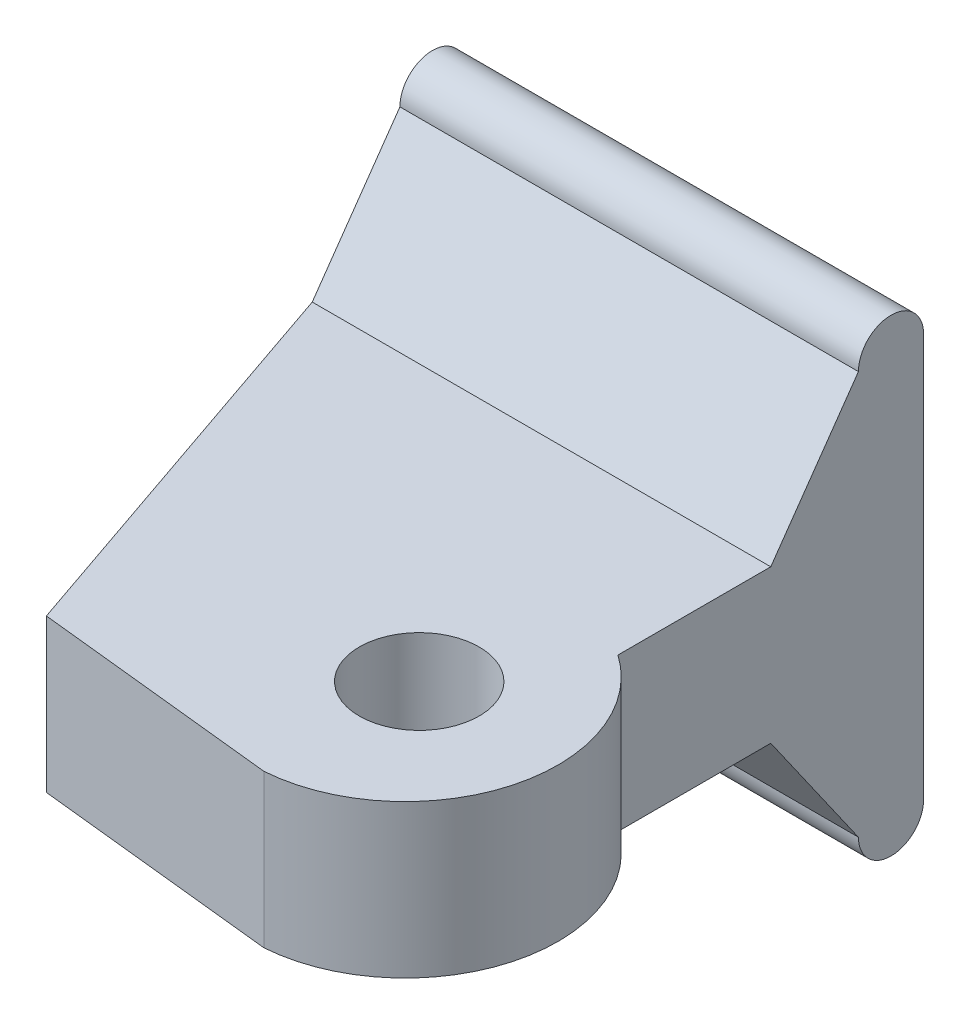
ISO-10303-21;
HEADER;
FILE_DESCRIPTION(('STEP AP214'),'2;1');
FILE_NAME('part.step','',(''),(''),'','','');
FILE_SCHEMA(('AUTOMOTIVE_DESIGN { 1 0 10303 214 1 1 1 1 }'));
ENDSEC;
DATA;
#1=APPLICATION_CONTEXT('core data for automotive mechanical design processes');
#2=APPLICATION_PROTOCOL_DEFINITION('international standard','automotive_design',2000,#1);
#3=PRODUCT_CONTEXT('',#1,'mechanical');
#4=PRODUCT('Part','Part','',(#3));
#5=PRODUCT_RELATED_PRODUCT_CATEGORY('part','',(#4));
#6=PRODUCT_DEFINITION_FORMATION('','',#4);
#7=PRODUCT_DEFINITION_CONTEXT('part definition',#1,'design');
#8=PRODUCT_DEFINITION('design','',#6,#7);
#9=PRODUCT_DEFINITION_SHAPE('','',#8);
#10=(LENGTH_UNIT() NAMED_UNIT(*) SI_UNIT(.MILLI.,.METRE.));
#11=(NAMED_UNIT(*) PLANE_ANGLE_UNIT() SI_UNIT($,.RADIAN.));
#12=(NAMED_UNIT(*) SI_UNIT($,.STERADIAN.) SOLID_ANGLE_UNIT());
#13=UNCERTAINTY_MEASURE_WITH_UNIT(LENGTH_MEASURE(1.E-05),#10,'distance_accuracy_value','');
#14=(GEOMETRIC_REPRESENTATION_CONTEXT(3) GLOBAL_UNCERTAINTY_ASSIGNED_CONTEXT((#13)) GLOBAL_UNIT_ASSIGNED_CONTEXT((#10,
#11,#12)) REPRESENTATION_CONTEXT('',''));
#15=CARTESIAN_POINT('',(0.,0.,0.));
#16=DIRECTION('',(0.,0.,1.));
#17=DIRECTION('',(1.,0.,0.));
#18=AXIS2_PLACEMENT_3D('',#15,#16,#17);
#19=CARTESIAN_POINT('',(9.06408672353238,6.35,11.5560190785289));
#20=DIRECTION('',(0.,1.,0.));
#21=DIRECTION('',(0.,0.,1.));
#22=AXIS2_PLACEMENT_3D('',#19,#20,#21);
#23=PLANE('',#22);
#24=CARTESIAN_POINT('',(9.06408672353238,6.35,11.5560190785289));
#25=DIRECTION('',(0.,1.,0.));
#26=DIRECTION('',(0.,0.,1.));
#27=AXIS2_PLACEMENT_3D('',#24,#25,#26);
#28=CIRCLE('',#27,6.35);
#29=CARTESIAN_POINT('',(9.52499999999998,6.35,17.889269346091));
#30=VERTEX_POINT('',#29);
#31=CARTESIAN_POINT('',(12.7,6.35,6.35000000000004));
#32=VERTEX_POINT('',#31);
#33=EDGE_CURVE('E157',#30,#32,#28,.T.);
#34=ORIENTED_EDGE('',*,*,#33,.T.);
#35=DIRECTION('',(0.,0.,-1.));
#36=VECTOR('',#35,1.);
#37=CARTESIAN_POINT('',(12.7,6.35,0.));
#38=LINE('',#37,#36);
#39=CARTESIAN_POINT('',(12.7,6.35,0.));
#40=VERTEX_POINT('',#39);
#41=EDGE_CURVE('E83',#32,#40,#38,.T.);
#42=ORIENTED_EDGE('',*,*,#41,.T.);
#43=DIRECTION('',(-1.,0.,0.));
#44=VECTOR('',#43,1.);
#45=CARTESIAN_POINT('',(-6.35,6.35,0.));
#46=LINE('',#45,#44);
#47=CARTESIAN_POINT('',(-6.35,6.35,0.));
#48=VERTEX_POINT('',#47);
#49=EDGE_CURVE('E128',#40,#48,#46,.T.);
#50=ORIENTED_EDGE('',*,*,#49,.T.);
#51=DIRECTION('',(0.324619143877709,0.,0.945844813607446));
#52=VECTOR('',#51,1.);
#53=CARTESIAN_POINT('',(-0.578271621854337,6.35,16.8171207859404));
#54=LINE('',#53,#52);
#55=CARTESIAN_POINT('',(-0.578271621854337,6.35,16.8171207859404));
#56=VERTEX_POINT('',#55);
#57=EDGE_CURVE('E134',#48,#56,#54,.T.);
#58=ORIENTED_EDGE('',*,*,#57,.T.);
#59=DIRECTION('',(0.994416498214008,0.,0.105526433085695));
#60=VECTOR('',#59,1.);
#61=CARTESIAN_POINT('',(9.52499999999998,6.35,17.889269346091));
#62=LINE('',#61,#60);
#63=EDGE_CURVE('E57',#56,#30,#62,.T.);
#64=ORIENTED_EDGE('',*,*,#63,.T.);
#65=EDGE_LOOP('',(#34,#42,#50,#58,#64));
#66=FACE_BOUND('',#65,.T.);
#67=CARTESIAN_POINT('',(9.52499999999998,6.35,11.4299999999999));
#68=DIRECTION('',(0.,1.,0.));
#69=DIRECTION('',(0.,0.,1.));
#70=AXIS2_PLACEMENT_3D('',#67,#68,#69);
#71=CIRCLE('',#70,2.4892);
#72=CARTESIAN_POINT('',(9.52499999999998,6.35,13.9191999999999));
#73=VERTEX_POINT('',#72);
#74=EDGE_CURVE('E148',#73,#73,#71,.T.);
#75=ORIENTED_EDGE('',*,*,#74,.F.);
#76=EDGE_LOOP('',(#75));
#77=FACE_BOUND('',#76,.T.);
#78=ADVANCED_FACE('F34',(#66,#77),#23,.T.);
#79=CARTESIAN_POINT('',(9.06408672353238,0.,11.5560190785289));
#80=DIRECTION('',(0.,1.,0.));
#81=DIRECTION('',(0.,0.,1.));
#82=AXIS2_PLACEMENT_3D('',#79,#80,#81);
#83=PLANE('',#82);
#84=CARTESIAN_POINT('',(9.06408672353238,0.,11.5560190785289));
#85=DIRECTION('',(0.,1.,0.));
#86=DIRECTION('',(0.,0.,1.));
#87=AXIS2_PLACEMENT_3D('',#84,#85,#86);
#88=CIRCLE('',#87,6.35);
#89=CARTESIAN_POINT('',(9.52499999999998,0.,17.889269346091));
#90=VERTEX_POINT('',#89);
#91=CARTESIAN_POINT('',(12.7,0.,6.35000000000004));
#92=VERTEX_POINT('',#91);
#93=EDGE_CURVE('E144',#90,#92,#88,.T.);
#94=ORIENTED_EDGE('',*,*,#93,.F.);
#95=DIRECTION('',(0.994416498214008,0.,0.105526433085695));
#96=VECTOR('',#95,1.);
#97=CARTESIAN_POINT('',(9.52499999999998,0.,17.889269346091));
#98=LINE('',#97,#96);
#99=CARTESIAN_POINT('',(-0.578271621854337,0.,16.8171207859404));
#100=VERTEX_POINT('',#99);
#101=EDGE_CURVE('E75',#100,#90,#98,.T.);
#102=ORIENTED_EDGE('',*,*,#101,.F.);
#103=DIRECTION('',(0.324619143877709,0.,0.945844813607446));
#104=VECTOR('',#103,1.);
#105=CARTESIAN_POINT('',(-0.578271621854337,0.,16.8171207859404));
#106=LINE('',#105,#104);
#107=CARTESIAN_POINT('',(-6.35,0.,0.));
#108=VERTEX_POINT('',#107);
#109=EDGE_CURVE('E154',#108,#100,#106,.T.);
#110=ORIENTED_EDGE('',*,*,#109,.F.);
#111=DIRECTION('',(-1.,0.,0.));
#112=VECTOR('',#111,1.);
#113=CARTESIAN_POINT('',(-6.35,0.,0.));
#114=LINE('',#113,#112);
#115=CARTESIAN_POINT('',(12.7,0.,0.));
#116=VERTEX_POINT('',#115);
#117=EDGE_CURVE('E151',#116,#108,#114,.T.);
#118=ORIENTED_EDGE('',*,*,#117,.F.);
#119=DIRECTION('',(0.,0.,-1.));
#120=VECTOR('',#119,1.);
#121=CARTESIAN_POINT('',(12.7,0.,0.));
#122=LINE('',#121,#120);
#123=EDGE_CURVE('E147',#92,#116,#122,.T.);
#124=ORIENTED_EDGE('',*,*,#123,.F.);
#125=EDGE_LOOP('',(#94,#102,#110,#118,#124));
#126=FACE_BOUND('',#125,.T.);
#127=CARTESIAN_POINT('',(9.52499999999998,0.,11.4299999999999));
#128=DIRECTION('',(0.,1.,0.));
#129=DIRECTION('',(0.,0.,1.));
#130=AXIS2_PLACEMENT_3D('',#127,#128,#129);
#131=CIRCLE('',#130,2.4892);
#132=CARTESIAN_POINT('',(9.52499999999998,0.,13.9191999999999));
#133=VERTEX_POINT('',#132);
#134=EDGE_CURVE('E189',#133,#133,#131,.T.);
#135=ORIENTED_EDGE('',*,*,#134,.T.);
#136=EDGE_LOOP('',(#135));
#137=FACE_BOUND('',#136,.T.);
#138=ADVANCED_FACE('F167',(#126,#137),#83,.F.);
#139=CARTESIAN_POINT('',(9.06408672353238,6.35,11.5560190785289));
#140=DIRECTION('',(0.,-1.,0.));
#141=DIRECTION('',(0.,0.,-1.));
#142=AXIS2_PLACEMENT_3D('',#139,#140,#141);
#143=CYLINDRICAL_SURFACE('',#142,6.35);
#144=ORIENTED_EDGE('',*,*,#93,.T.);
#145=DIRECTION('',(0.,-1.,0.));
#146=VECTOR('',#145,1.);
#147=CARTESIAN_POINT('',(12.7,6.35,6.35000000000004));
#148=LINE('',#147,#146);
#149=EDGE_CURVE('E42',#32,#92,#148,.T.);
#150=ORIENTED_EDGE('',*,*,#149,.F.);
#151=ORIENTED_EDGE('',*,*,#33,.F.);
#152=DIRECTION('',(0.,-1.,0.));
#153=VECTOR('',#152,1.);
#154=CARTESIAN_POINT('',(9.52499999999998,6.35,17.889269346091));
#155=LINE('',#154,#153);
#156=EDGE_CURVE('E140',#30,#90,#155,.T.);
#157=ORIENTED_EDGE('',*,*,#156,.T.);
#158=EDGE_LOOP('',(#144,#150,#151,#157));
#159=FACE_BOUND('',#158,.T.);
#160=ADVANCED_FACE('F36',(#159),#143,.T.);
#161=CARTESIAN_POINT('',(12.7,6.35,0.));
#162=DIRECTION('',(-1.,0.,0.));
#163=DIRECTION('',(0.,0.,1.));
#164=AXIS2_PLACEMENT_3D('',#161,#162,#163);
#165=PLANE('',#164);
#166=ORIENTED_EDGE('',*,*,#123,.T.);
#167=DIRECTION('',(0.,-0.819152044288995,-0.573576436351042));
#168=VECTOR('',#167,1.);
#169=CARTESIAN_POINT('',(12.7,-5.20161548123512,-3.64221037082912));
#170=LINE('',#169,#168);
#171=CARTESIAN_POINT('',(12.7,-5.20161548123512,-3.64221037082913));
#172=VERTEX_POINT('',#171);
#173=EDGE_CURVE('E130',#116,#172,#170,.T.);
#174=ORIENTED_EDGE('',*,*,#173,.T.);
#175=CARTESIAN_POINT('',(12.7,-5.20161548123509,-4.99610518541458));
#176=DIRECTION('',(1.,0.,0.));
#177=DIRECTION('',(0.,0.,-1.));
#178=AXIS2_PLACEMENT_3D('',#175,#176,#177);
#179=CIRCLE('',#178,1.35389481458544);
#180=CARTESIAN_POINT('',(12.7,-5.20161548123512,-6.35));
#181=VERTEX_POINT('',#180);
#182=EDGE_CURVE('E175',#172,#181,#179,.T.);
#183=ORIENTED_EDGE('',*,*,#182,.T.);
#184=DIRECTION('',(0.,1.,0.));
#185=VECTOR('',#184,1.);
#186=CARTESIAN_POINT('',(12.7,11.5516154812351,-6.35));
#187=LINE('',#186,#185);
#188=CARTESIAN_POINT('',(12.7,11.5516154812351,-6.34999999999998));
#189=VERTEX_POINT('',#188);
#190=EDGE_CURVE('E177',#181,#189,#187,.T.);
#191=ORIENTED_EDGE('',*,*,#190,.T.);
#192=CARTESIAN_POINT('',(12.7,11.5516154812351,-4.99610518541456));
#193=DIRECTION('',(1.,0.,0.));
#194=DIRECTION('',(0.,0.,-1.));
#195=AXIS2_PLACEMENT_3D('',#192,#193,#194);
#196=CIRCLE('',#195,1.35389481458543);
#197=CARTESIAN_POINT('',(12.7,11.5516154812351,-3.64221037082915));
#198=VERTEX_POINT('',#197);
#199=EDGE_CURVE('E183',#189,#198,#196,.T.);
#200=ORIENTED_EDGE('',*,*,#199,.T.);
#201=DIRECTION('',(0.,-0.819152044288987,0.573576436351053));
#202=VECTOR('',#201,1.);
#203=CARTESIAN_POINT('',(12.7,6.35,0.));
#204=LINE('',#203,#202);
#205=EDGE_CURVE('E186',#198,#40,#204,.T.);
#206=ORIENTED_EDGE('',*,*,#205,.T.);
#207=ORIENTED_EDGE('',*,*,#41,.F.);
#208=ORIENTED_EDGE('',*,*,#149,.T.);
#209=EDGE_LOOP('',(#166,#174,#183,#191,#200,#206,#207,#208));
#210=FACE_BOUND('',#209,.T.);
#211=ADVANCED_FACE('F160',(#210),#165,.F.);
#212=CARTESIAN_POINT('',(-0.578271621854337,6.35,16.8171207859404));
#213=DIRECTION('',(0.945844813607445,0.,-0.324619143877709));
#214=DIRECTION('',(-0.324619143877709,0.,-0.945844813607446));
#215=AXIS2_PLACEMENT_3D('',#212,#213,#214);
#216=PLANE('',#215);
#217=ORIENTED_EDGE('',*,*,#57,.F.);
#218=DIRECTION('',(0.,-1.,0.));
#219=VECTOR('',#218,1.);
#220=CARTESIAN_POINT('',(-6.35,12.9055102958205,0.));
#221=LINE('',#220,#219);
#222=EDGE_CURVE('E112',#48,#108,#221,.T.);
#223=ORIENTED_EDGE('',*,*,#222,.T.);
#224=ORIENTED_EDGE('',*,*,#109,.T.);
#225=DIRECTION('',(0.,-1.,0.));
#226=VECTOR('',#225,1.);
#227=CARTESIAN_POINT('',(-0.578271621854337,6.35,16.8171207859404));
#228=LINE('',#227,#226);
#229=EDGE_CURVE('E138',#56,#100,#228,.T.);
#230=ORIENTED_EDGE('',*,*,#229,.F.);
#231=EDGE_LOOP('',(#217,#223,#224,#230));
#232=FACE_BOUND('',#231,.T.);
#233=ADVANCED_FACE('F137',(#232),#216,.F.);
#234=CARTESIAN_POINT('',(9.52499999999998,6.35,17.889269346091));
#235=DIRECTION('',(0.105526433085695,0.,-0.994416498214008));
#236=DIRECTION('',(-0.994416498214008,0.,-0.105526433085695));
#237=AXIS2_PLACEMENT_3D('',#234,#235,#236);
#238=PLANE('',#237);
#239=ORIENTED_EDGE('',*,*,#101,.T.);
#240=ORIENTED_EDGE('',*,*,#156,.F.);
#241=ORIENTED_EDGE('',*,*,#63,.F.);
#242=ORIENTED_EDGE('',*,*,#229,.T.);
#243=EDGE_LOOP('',(#239,#240,#241,#242));
#244=FACE_BOUND('',#243,.T.);
#245=ADVANCED_FACE('F203',(#244),#238,.F.);
#246=CARTESIAN_POINT('',(9.52499999999998,6.35,11.4299999999999));
#247=DIRECTION('',(0.,-1.,0.));
#248=DIRECTION('',(0.,0.,-1.));
#249=AXIS2_PLACEMENT_3D('',#246,#247,#248);
#250=CYLINDRICAL_SURFACE('',#249,2.4892);
#251=ORIENTED_EDGE('',*,*,#74,.T.);
#252=EDGE_LOOP('',(#251));
#253=FACE_BOUND('',#252,.T.);
#254=ORIENTED_EDGE('',*,*,#134,.F.);
#255=EDGE_LOOP('',(#254));
#256=FACE_BOUND('',#255,.T.);
#257=ADVANCED_FACE('F201',(#253,#256),#250,.F.);
#258=CARTESIAN_POINT('',(-28.4965186692293,6.35,0.));
#259=DIRECTION('',(0.,0.573576436351053,0.819152044288987));
#260=DIRECTION('',(0.,-0.819152044288987,0.573576436351053));
#261=AXIS2_PLACEMENT_3D('',#258,#259,#260);
#262=PLANE('',#261);
#263=DIRECTION('',(0.,0.819152044288987,-0.573576436351053));
#264=VECTOR('',#263,1.);
#265=CARTESIAN_POINT('',(-6.35,6.35,0.));
#266=LINE('',#265,#264);
#267=CARTESIAN_POINT('',(-6.35,11.5516154812351,-3.64221037082913));
#268=VERTEX_POINT('',#267);
#269=EDGE_CURVE('E115',#48,#268,#266,.T.);
#270=ORIENTED_EDGE('',*,*,#269,.F.);
#271=ORIENTED_EDGE('',*,*,#49,.F.);
#272=ORIENTED_EDGE('',*,*,#205,.F.);
#273=DIRECTION('',(1.,0.,0.));
#274=VECTOR('',#273,1.);
#275=CARTESIAN_POINT('',(-28.4965186692293,11.5516154812351,-3.64221037082915));
#276=LINE('',#275,#274);
#277=EDGE_CURVE('E129',#268,#198,#276,.T.);
#278=ORIENTED_EDGE('',*,*,#277,.F.);
#279=EDGE_LOOP('',(#270,#271,#272,#278));
#280=FACE_BOUND('',#279,.T.);
#281=ADVANCED_FACE('F126',(#280),#262,.T.);
#282=CARTESIAN_POINT('',(-28.4965186692293,11.5516154812351,-4.99610518541456));
#283=DIRECTION('',(1.,0.,0.));
#284=DIRECTION('',(0.,0.,-1.));
#285=AXIS2_PLACEMENT_3D('',#282,#283,#284);
#286=CYLINDRICAL_SURFACE('',#285,1.35389481458543);
#287=CARTESIAN_POINT('',(-6.35,11.5516154812351,-4.99610518541456));
#288=DIRECTION('',(1.,0.,0.));
#289=DIRECTION('',(0.,0.,-1.));
#290=AXIS2_PLACEMENT_3D('',#287,#288,#289);
#291=CIRCLE('',#290,1.35389481458543);
#292=CARTESIAN_POINT('',(-6.35,11.5516154812351,-6.35));
#293=VERTEX_POINT('',#292);
#294=EDGE_CURVE('E131',#268,#293,#291,.F.);
#295=ORIENTED_EDGE('',*,*,#294,.F.);
#296=ORIENTED_EDGE('',*,*,#277,.T.);
#297=ORIENTED_EDGE('',*,*,#199,.F.);
#298=DIRECTION('',(1.,0.,0.));
#299=VECTOR('',#298,1.);
#300=CARTESIAN_POINT('',(-28.4965186692293,11.5516154812351,-6.34999999999998));
#301=LINE('',#300,#299);
#302=EDGE_CURVE('E190',#293,#189,#301,.T.);
#303=ORIENTED_EDGE('',*,*,#302,.F.);
#304=EDGE_LOOP('',(#295,#296,#297,#303));
#305=FACE_BOUND('',#304,.T.);
#306=ADVANCED_FACE('F210',(#305),#286,.T.);
#307=CARTESIAN_POINT('',(-28.4965186692293,11.5516154812351,-6.35));
#308=DIRECTION('',(0.,0.,-1.));
#309=DIRECTION('',(0.,1.,0.));
#310=AXIS2_PLACEMENT_3D('',#307,#308,#309);
#311=PLANE('',#310);
#312=DIRECTION('',(0.,-1.,0.));
#313=VECTOR('',#312,1.);
#314=CARTESIAN_POINT('',(-6.35,12.9055102958205,-6.35));
#315=LINE('',#314,#313);
#316=CARTESIAN_POINT('',(-6.35,-5.20161548123509,-6.35));
#317=VERTEX_POINT('',#316);
#318=EDGE_CURVE('E120',#293,#317,#315,.T.);
#319=ORIENTED_EDGE('',*,*,#318,.F.);
#320=ORIENTED_EDGE('',*,*,#302,.T.);
#321=ORIENTED_EDGE('',*,*,#190,.F.);
#322=DIRECTION('',(1.,0.,0.));
#323=VECTOR('',#322,1.);
#324=CARTESIAN_POINT('',(-28.4965186692293,-5.20161548123512,-6.35));
#325=LINE('',#324,#323);
#326=EDGE_CURVE('E192',#317,#181,#325,.T.);
#327=ORIENTED_EDGE('',*,*,#326,.F.);
#328=EDGE_LOOP('',(#319,#320,#321,#327));
#329=FACE_BOUND('',#328,.T.);
#330=ADVANCED_FACE('F258',(#329),#311,.T.);
#331=CARTESIAN_POINT('',(-28.4965186692293,-5.20161548123509,-4.99610518541458));
#332=DIRECTION('',(1.,0.,0.));
#333=DIRECTION('',(0.,0.,-1.));
#334=AXIS2_PLACEMENT_3D('',#331,#332,#333);
#335=CYLINDRICAL_SURFACE('',#334,1.35389481458544);
#336=CARTESIAN_POINT('',(-6.35,-5.20161548123509,-4.99610518541458));
#337=DIRECTION('',(1.,0.,0.));
#338=DIRECTION('',(0.,0.,-1.));
#339=AXIS2_PLACEMENT_3D('',#336,#337,#338);
#340=CIRCLE('',#339,1.35389481458544);
#341=CARTESIAN_POINT('',(-6.35,-5.20161548123512,-3.64221037082913));
#342=VERTEX_POINT('',#341);
#343=EDGE_CURVE('E48',#317,#342,#340,.F.);
#344=ORIENTED_EDGE('',*,*,#343,.F.);
#345=ORIENTED_EDGE('',*,*,#326,.T.);
#346=ORIENTED_EDGE('',*,*,#182,.F.);
#347=DIRECTION('',(1.,0.,0.));
#348=VECTOR('',#347,1.);
#349=CARTESIAN_POINT('',(-28.4965186692293,-5.20161548123512,-3.64221037082913));
#350=LINE('',#349,#348);
#351=EDGE_CURVE('E172',#342,#172,#350,.T.);
#352=ORIENTED_EDGE('',*,*,#351,.F.);
#353=EDGE_LOOP('',(#344,#345,#346,#352));
#354=FACE_BOUND('',#353,.T.);
#355=ADVANCED_FACE('F268',(#354),#335,.T.);
#356=CARTESIAN_POINT('',(-28.4965186692293,-5.20161548123512,-3.64221037082912));
#357=DIRECTION('',(0.,-0.573576436351042,0.819152044288995));
#358=DIRECTION('',(0.,-0.819152044288995,-0.573576436351042));
#359=AXIS2_PLACEMENT_3D('',#356,#357,#358);
#360=PLANE('',#359);
#361=DIRECTION('',(0.,0.819152044288995,0.573576436351042));
#362=VECTOR('',#361,1.);
#363=CARTESIAN_POINT('',(-6.35,-5.20161548123512,-3.64221037082912));
#364=LINE('',#363,#362);
#365=EDGE_CURVE('E11',#342,#108,#364,.T.);
#366=ORIENTED_EDGE('',*,*,#365,.F.);
#367=ORIENTED_EDGE('',*,*,#351,.T.);
#368=ORIENTED_EDGE('',*,*,#173,.F.);
#369=ORIENTED_EDGE('',*,*,#117,.T.);
#370=EDGE_LOOP('',(#366,#367,#368,#369));
#371=FACE_BOUND('',#370,.T.);
#372=ADVANCED_FACE('F170',(#371),#360,.T.);
#373=CARTESIAN_POINT('',(-6.35,12.9055102958205,0.));
#374=DIRECTION('',(1.,0.,0.));
#375=DIRECTION('',(0.,0.,-1.));
#376=AXIS2_PLACEMENT_3D('',#373,#374,#375);
#377=PLANE('',#376);
#378=ORIENTED_EDGE('',*,*,#269,.T.);
#379=ORIENTED_EDGE('',*,*,#294,.T.);
#380=ORIENTED_EDGE('',*,*,#318,.T.);
#381=ORIENTED_EDGE('',*,*,#343,.T.);
#382=ORIENTED_EDGE('',*,*,#365,.T.);
#383=ORIENTED_EDGE('',*,*,#222,.F.);
#384=EDGE_LOOP('',(#378,#379,#380,#381,#382,#383));
#385=FACE_BOUND('',#384,.T.);
#386=ADVANCED_FACE('F114',(#385),#377,.F.);
#387=CLOSED_SHELL('',(#78,#138,#160,#211,#233,#245,#257,#281,#306,#330,#355,#372,#386));
#388=MANIFOLD_SOLID_BREP('B2',#387);
#389=ADVANCED_BREP_SHAPE_REPRESENTATION('',(#18,#388),#14);
#390=SHAPE_DEFINITION_REPRESENTATION(#9,#389);
ENDSEC;
END-ISO-10303-21;
